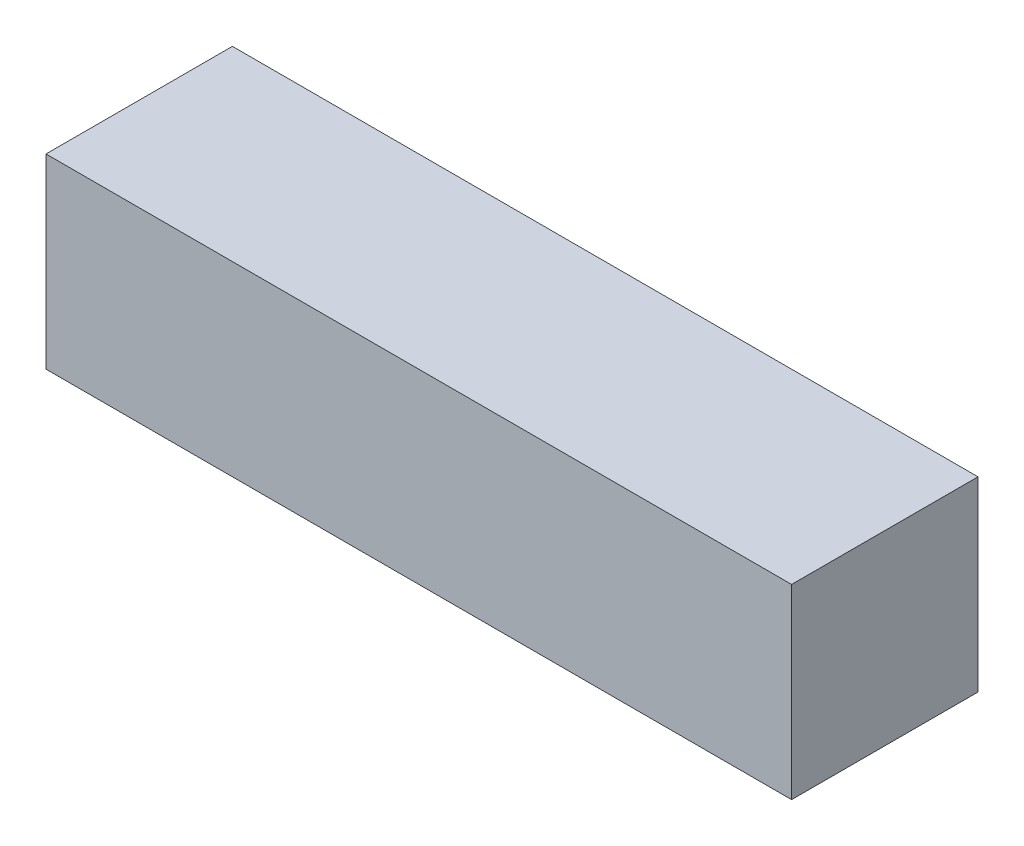
ISO-10303-21;
HEADER;
FILE_DESCRIPTION(('STEP AP214'),'2;1');
FILE_NAME('part.step','',(''),(''),'','','');
FILE_SCHEMA(('AUTOMOTIVE_DESIGN { 1 0 10303 214 1 1 1 1 }'));
ENDSEC;
DATA;
#1=APPLICATION_CONTEXT('core data for automotive mechanical design processes');
#2=APPLICATION_PROTOCOL_DEFINITION('international standard','automotive_design',2000,#1);
#3=PRODUCT_CONTEXT('',#1,'mechanical');
#4=PRODUCT('Part','Part','',(#3));
#5=PRODUCT_RELATED_PRODUCT_CATEGORY('part','',(#4));
#6=PRODUCT_DEFINITION_FORMATION('','',#4);
#7=PRODUCT_DEFINITION_CONTEXT('part definition',#1,'design');
#8=PRODUCT_DEFINITION('design','',#6,#7);
#9=PRODUCT_DEFINITION_SHAPE('','',#8);
#10=(LENGTH_UNIT() NAMED_UNIT(*) SI_UNIT(.MILLI.,.METRE.));
#11=(NAMED_UNIT(*) PLANE_ANGLE_UNIT() SI_UNIT($,.RADIAN.));
#12=(NAMED_UNIT(*) SI_UNIT($,.STERADIAN.) SOLID_ANGLE_UNIT());
#13=UNCERTAINTY_MEASURE_WITH_UNIT(LENGTH_MEASURE(1.E-05),#10,'distance_accuracy_value','');
#14=(GEOMETRIC_REPRESENTATION_CONTEXT(3) GLOBAL_UNCERTAINTY_ASSIGNED_CONTEXT((#13)) GLOBAL_UNIT_ASSIGNED_CONTEXT((#10,
#11,#12)) REPRESENTATION_CONTEXT('',''));
#15=CARTESIAN_POINT('',(0.,0.,0.));
#16=DIRECTION('',(0.,0.,1.));
#17=DIRECTION('',(1.,0.,0.));
#18=AXIS2_PLACEMENT_3D('',#15,#16,#17);
#19=CARTESIAN_POINT('',(19.05,0.,4.7625));
#20=DIRECTION('',(0.,0.,-1.));
#21=DIRECTION('',(-1.,0.,0.));
#22=AXIS2_PLACEMENT_3D('',#19,#20,#21);
#23=PLANE('',#22);
#24=DIRECTION('',(0.,-1.,0.));
#25=VECTOR('',#24,1.);
#26=CARTESIAN_POINT('',(-19.05,0.,4.7625));
#27=LINE('',#26,#25);
#28=CARTESIAN_POINT('',(-19.05,4.7625,4.7625));
#29=VERTEX_POINT('',#28);
#30=CARTESIAN_POINT('',(-19.05,-4.7625,4.7625));
#31=VERTEX_POINT('',#30);
#32=EDGE_CURVE('E109',#29,#31,#27,.T.);
#33=ORIENTED_EDGE('',*,*,#32,.T.);
#34=DIRECTION('',(-1.,0.,0.));
#35=VECTOR('',#34,1.);
#36=CARTESIAN_POINT('',(19.05,-4.7625,4.7625));
#37=LINE('',#36,#35);
#38=CARTESIAN_POINT('',(19.05,-4.7625,4.7625));
#39=VERTEX_POINT('',#38);
#40=EDGE_CURVE('E11',#39,#31,#37,.T.);
#41=ORIENTED_EDGE('',*,*,#40,.F.);
#42=DIRECTION('',(0.,-1.,0.));
#43=VECTOR('',#42,1.);
#44=CARTESIAN_POINT('',(19.05,0.,4.7625));
#45=LINE('',#44,#43);
#46=CARTESIAN_POINT('',(19.05,4.7625,4.7625));
#47=VERTEX_POINT('',#46);
#48=EDGE_CURVE('E93',#47,#39,#45,.T.);
#49=ORIENTED_EDGE('',*,*,#48,.F.);
#50=DIRECTION('',(-1.,0.,0.));
#51=VECTOR('',#50,1.);
#52=CARTESIAN_POINT('',(19.05,4.7625,4.7625));
#53=LINE('',#52,#51);
#54=EDGE_CURVE('E105',#47,#29,#53,.T.);
#55=ORIENTED_EDGE('',*,*,#54,.T.);
#56=EDGE_LOOP('',(#33,#41,#49,#55));
#57=FACE_BOUND('',#56,.T.);
#58=ADVANCED_FACE('F41',(#57),#23,.F.);
#59=CARTESIAN_POINT('',(19.05,-4.7625,0.));
#60=DIRECTION('',(0.,1.,0.));
#61=DIRECTION('',(0.,0.,1.));
#62=AXIS2_PLACEMENT_3D('',#59,#60,#61);
#63=PLANE('',#62);
#64=DIRECTION('',(0.,0.,-1.));
#65=VECTOR('',#64,1.);
#66=CARTESIAN_POINT('',(-19.05,-4.7625,0.));
#67=LINE('',#66,#65);
#68=CARTESIAN_POINT('',(-19.05,-4.7625,-4.7625));
#69=VERTEX_POINT('',#68);
#70=EDGE_CURVE('E98',#31,#69,#67,.T.);
#71=ORIENTED_EDGE('',*,*,#70,.T.);
#72=DIRECTION('',(-1.,0.,0.));
#73=VECTOR('',#72,1.);
#74=CARTESIAN_POINT('',(19.05,-4.7625,-4.7625));
#75=LINE('',#74,#73);
#76=CARTESIAN_POINT('',(19.05,-4.7625,-4.7625));
#77=VERTEX_POINT('',#76);
#78=EDGE_CURVE('E50',#77,#69,#75,.T.);
#79=ORIENTED_EDGE('',*,*,#78,.F.);
#80=DIRECTION('',(0.,0.,-1.));
#81=VECTOR('',#80,1.);
#82=CARTESIAN_POINT('',(19.05,-4.7625,0.));
#83=LINE('',#82,#81);
#84=EDGE_CURVE('E88',#39,#77,#83,.T.);
#85=ORIENTED_EDGE('',*,*,#84,.F.);
#86=ORIENTED_EDGE('',*,*,#40,.T.);
#87=EDGE_LOOP('',(#71,#79,#85,#86));
#88=FACE_BOUND('',#87,.T.);
#89=ADVANCED_FACE('F97',(#88),#63,.F.);
#90=CARTESIAN_POINT('',(19.05,0.,-4.7625));
#91=DIRECTION('',(0.,0.,1.));
#92=DIRECTION('',(0.,-1.,0.));
#93=AXIS2_PLACEMENT_3D('',#90,#91,#92);
#94=PLANE('',#93);
#95=DIRECTION('',(0.,1.,0.));
#96=VECTOR('',#95,1.);
#97=CARTESIAN_POINT('',(-19.05,0.,-4.7625));
#98=LINE('',#97,#96);
#99=CARTESIAN_POINT('',(-19.05,4.7625,-4.7625));
#100=VERTEX_POINT('',#99);
#101=EDGE_CURVE('E75',#69,#100,#98,.T.);
#102=ORIENTED_EDGE('',*,*,#101,.T.);
#103=DIRECTION('',(-1.,0.,0.));
#104=VECTOR('',#103,1.);
#105=CARTESIAN_POINT('',(19.05,4.7625,-4.7625));
#106=LINE('',#105,#104);
#107=CARTESIAN_POINT('',(19.05,4.7625,-4.7625));
#108=VERTEX_POINT('',#107);
#109=EDGE_CURVE('E100',#108,#100,#106,.T.);
#110=ORIENTED_EDGE('',*,*,#109,.F.);
#111=DIRECTION('',(0.,1.,0.));
#112=VECTOR('',#111,1.);
#113=CARTESIAN_POINT('',(19.05,0.,-4.7625));
#114=LINE('',#113,#112);
#115=EDGE_CURVE('E91',#77,#108,#114,.T.);
#116=ORIENTED_EDGE('',*,*,#115,.F.);
#117=ORIENTED_EDGE('',*,*,#78,.T.);
#118=EDGE_LOOP('',(#102,#110,#116,#117));
#119=FACE_BOUND('',#118,.T.);
#120=ADVANCED_FACE('F101',(#119),#94,.F.);
#121=CARTESIAN_POINT('',(19.05,4.7625,0.));
#122=DIRECTION('',(0.,-1.,0.));
#123=DIRECTION('',(0.,0.,-1.));
#124=AXIS2_PLACEMENT_3D('',#121,#122,#123);
#125=PLANE('',#124);
#126=DIRECTION('',(0.,0.,1.));
#127=VECTOR('',#126,1.);
#128=CARTESIAN_POINT('',(-19.05,4.7625,0.));
#129=LINE('',#128,#127);
#130=EDGE_CURVE('E81',#100,#29,#129,.T.);
#131=ORIENTED_EDGE('',*,*,#130,.T.);
#132=ORIENTED_EDGE('',*,*,#54,.F.);
#133=DIRECTION('',(0.,0.,1.));
#134=VECTOR('',#133,1.);
#135=CARTESIAN_POINT('',(19.05,4.7625,0.));
#136=LINE('',#135,#134);
#137=EDGE_CURVE('E58',#108,#47,#136,.T.);
#138=ORIENTED_EDGE('',*,*,#137,.F.);
#139=ORIENTED_EDGE('',*,*,#109,.T.);
#140=EDGE_LOOP('',(#131,#132,#138,#139));
#141=FACE_BOUND('',#140,.T.);
#142=ADVANCED_FACE('F122',(#141),#125,.F.);
#143=CARTESIAN_POINT('',(19.05,0.,0.));
#144=DIRECTION('',(1.,0.,0.));
#145=DIRECTION('',(0.,0.,-1.));
#146=AXIS2_PLACEMENT_3D('',#143,#144,#145);
#147=PLANE('',#146);
#148=ORIENTED_EDGE('',*,*,#48,.T.);
#149=ORIENTED_EDGE('',*,*,#84,.T.);
#150=ORIENTED_EDGE('',*,*,#115,.T.);
#151=ORIENTED_EDGE('',*,*,#137,.T.);
#152=EDGE_LOOP('',(#148,#149,#150,#151));
#153=FACE_BOUND('',#152,.T.);
#154=ADVANCED_FACE('F89',(#153),#147,.T.);
#155=CARTESIAN_POINT('',(-19.05,0.,0.));
#156=DIRECTION('',(1.,0.,0.));
#157=DIRECTION('',(0.,0.,-1.));
#158=AXIS2_PLACEMENT_3D('',#155,#156,#157);
#159=PLANE('',#158);
#160=ORIENTED_EDGE('',*,*,#32,.F.);
#161=ORIENTED_EDGE('',*,*,#130,.F.);
#162=ORIENTED_EDGE('',*,*,#101,.F.);
#163=ORIENTED_EDGE('',*,*,#70,.F.);
#164=EDGE_LOOP('',(#160,#161,#162,#163));
#165=FACE_BOUND('',#164,.T.);
#166=ADVANCED_FACE('F125',(#165),#159,.F.);
#167=CLOSED_SHELL('',(#58,#89,#120,#142,#154,#166));
#168=MANIFOLD_SOLID_BREP('B2',#167);
#169=ADVANCED_BREP_SHAPE_REPRESENTATION('',(#18,#168),#14);
#170=SHAPE_DEFINITION_REPRESENTATION(#9,#169);
ENDSEC;
END-ISO-10303-21;
